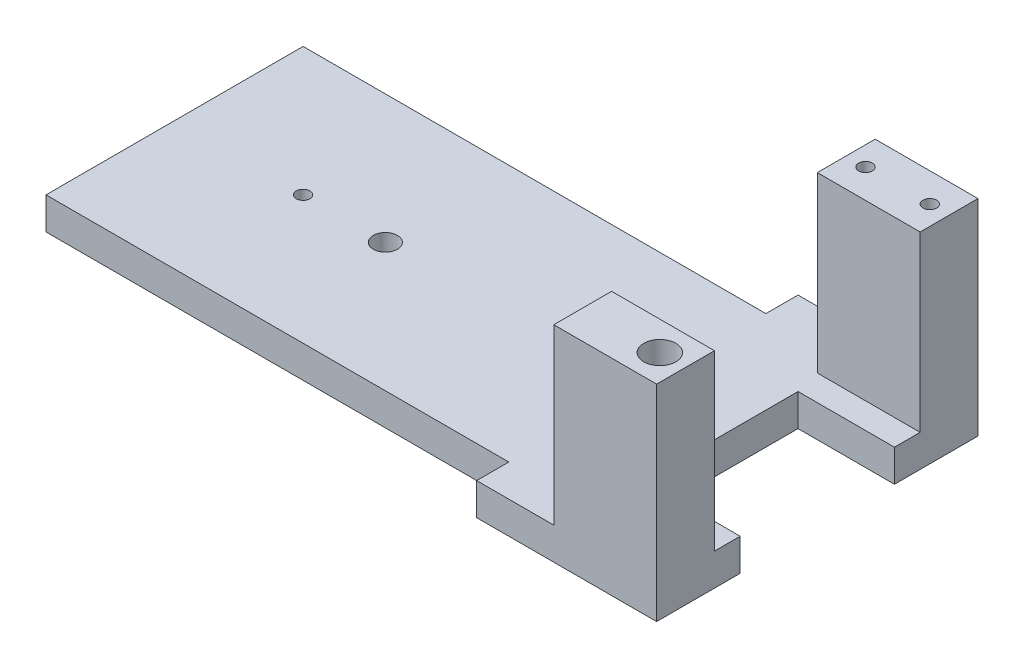
ISO-10303-21;
HEADER;
FILE_DESCRIPTION(('STEP AP214'),'2;1');
FILE_NAME('part.step','',(''),(''),'','','');
FILE_SCHEMA(('AUTOMOTIVE_DESIGN { 1 0 10303 214 1 1 1 1 }'));
ENDSEC;
DATA;
#1=APPLICATION_CONTEXT('core data for automotive mechanical design processes');
#2=APPLICATION_PROTOCOL_DEFINITION('international standard','automotive_design',2000,#1);
#3=PRODUCT_CONTEXT('',#1,'mechanical');
#4=PRODUCT('Part','Part','',(#3));
#5=PRODUCT_RELATED_PRODUCT_CATEGORY('part','',(#4));
#6=PRODUCT_DEFINITION_FORMATION('','',#4);
#7=PRODUCT_DEFINITION_CONTEXT('part definition',#1,'design');
#8=PRODUCT_DEFINITION('design','',#6,#7);
#9=PRODUCT_DEFINITION_SHAPE('','',#8);
#10=(LENGTH_UNIT() NAMED_UNIT(*) SI_UNIT(.MILLI.,.METRE.));
#11=(NAMED_UNIT(*) PLANE_ANGLE_UNIT() SI_UNIT($,.RADIAN.));
#12=(NAMED_UNIT(*) SI_UNIT($,.STERADIAN.) SOLID_ANGLE_UNIT());
#13=UNCERTAINTY_MEASURE_WITH_UNIT(LENGTH_MEASURE(1.E-05),#10,'distance_accuracy_value','');
#14=(GEOMETRIC_REPRESENTATION_CONTEXT(3) GLOBAL_UNCERTAINTY_ASSIGNED_CONTEXT((#13)) GLOBAL_UNIT_ASSIGNED_CONTEXT((#10,
#11,#12)) REPRESENTATION_CONTEXT('',''));
#15=CARTESIAN_POINT('',(0.,0.,0.));
#16=DIRECTION('',(0.,0.,1.));
#17=DIRECTION('',(1.,0.,0.));
#18=AXIS2_PLACEMENT_3D('',#15,#16,#17);
#19=CARTESIAN_POINT('',(127.,-6.35,-6.34999999999999));
#20=DIRECTION('',(1.,0.,0.));
#21=DIRECTION('',(0.,0.,-1.));
#22=AXIS2_PLACEMENT_3D('',#19,#20,#21);
#23=PLANE('',#22);
#24=DIRECTION('',(0.,1.,0.));
#25=VECTOR('',#24,1.);
#26=CARTESIAN_POINT('',(127.,-12.7,-22.86));
#27=LINE('',#26,#25);
#28=CARTESIAN_POINT('',(127.,-6.35,-22.86));
#29=VERTEX_POINT('',#28);
#30=CARTESIAN_POINT('',(127.,0.,-22.86));
#31=VERTEX_POINT('',#30);
#32=EDGE_CURVE('E186',#29,#31,#27,.T.);
#33=ORIENTED_EDGE('',*,*,#32,.T.);
#34=DIRECTION('',(0.,0.,-1.));
#35=VECTOR('',#34,1.);
#36=CARTESIAN_POINT('',(127.,0.,-6.34999999999999));
#37=LINE('',#36,#35);
#38=CARTESIAN_POINT('',(127.,0.,-17.78));
#39=VERTEX_POINT('',#38);
#40=EDGE_CURVE('E246',#39,#31,#37,.T.);
#41=ORIENTED_EDGE('',*,*,#40,.F.);
#42=DIRECTION('',(0.,-1.,0.));
#43=VECTOR('',#42,1.);
#44=CARTESIAN_POINT('',(127.,34.29,-17.78));
#45=LINE('',#44,#43);
#46=CARTESIAN_POINT('',(127.,34.29,-17.78));
#47=VERTEX_POINT('',#46);
#48=EDGE_CURVE('E214',#47,#39,#45,.T.);
#49=ORIENTED_EDGE('',*,*,#48,.F.);
#50=DIRECTION('',(0.,0.,-1.));
#51=VECTOR('',#50,1.);
#52=CARTESIAN_POINT('',(127.,34.29,0.));
#53=LINE('',#52,#51);
#54=CARTESIAN_POINT('',(127.,34.29,-6.34999999999999));
#55=VERTEX_POINT('',#54);
#56=EDGE_CURVE('E204',#55,#47,#53,.T.);
#57=ORIENTED_EDGE('',*,*,#56,.F.);
#58=DIRECTION('',(0.,1.,0.));
#59=VECTOR('',#58,1.);
#60=CARTESIAN_POINT('',(127.,-6.35,-6.34999999999999));
#61=LINE('',#60,#59);
#62=CARTESIAN_POINT('',(127.,-6.35,-6.34999999999999));
#63=VERTEX_POINT('',#62);
#64=EDGE_CURVE('E11',#63,#55,#61,.T.);
#65=ORIENTED_EDGE('',*,*,#64,.F.);
#66=DIRECTION('',(0.,0.,-1.));
#67=VECTOR('',#66,1.);
#68=CARTESIAN_POINT('',(127.,-6.35,-6.34999999999999));
#69=LINE('',#68,#67);
#70=EDGE_CURVE('E357',#63,#29,#69,.T.);
#71=ORIENTED_EDGE('',*,*,#70,.T.);
#72=EDGE_LOOP('',(#33,#41,#49,#57,#65,#71));
#73=FACE_BOUND('',#72,.T.);
#74=ADVANCED_FACE('F35',(#73),#23,.T.);
#75=DIRECTION('',(0.,1.,0.));
#76=VECTOR('',#75,1.);
#77=CARTESIAN_POINT('',(127.,-12.7,-53.34));
#78=LINE('',#77,#76);
#79=CARTESIAN_POINT('',(127.,-6.35,-53.34));
#80=VERTEX_POINT('',#79);
#81=CARTESIAN_POINT('',(127.,0.,-53.34));
#82=VERTEX_POINT('',#81);
#83=EDGE_CURVE('E53',#80,#82,#78,.T.);
#84=ORIENTED_EDGE('',*,*,#83,.F.);
#85=CARTESIAN_POINT('',(127.,-6.35,-69.85));
#86=VERTEX_POINT('',#85);
#87=EDGE_CURVE('E308',#80,#86,#69,.T.);
#88=ORIENTED_EDGE('',*,*,#87,.T.);
#89=DIRECTION('',(0.,1.,0.));
#90=VECTOR('',#89,1.);
#91=CARTESIAN_POINT('',(127.,-6.35,-69.85));
#92=LINE('',#91,#90);
#93=CARTESIAN_POINT('',(127.,34.29,-69.85));
#94=VERTEX_POINT('',#93);
#95=EDGE_CURVE('E261',#86,#94,#92,.T.);
#96=ORIENTED_EDGE('',*,*,#95,.T.);
#97=DIRECTION('',(0.,0.,-1.));
#98=VECTOR('',#97,1.);
#99=CARTESIAN_POINT('',(127.,34.29,0.));
#100=LINE('',#99,#98);
#101=CARTESIAN_POINT('',(127.,34.29,-58.42));
#102=VERTEX_POINT('',#101);
#103=EDGE_CURVE('E229',#102,#94,#100,.T.);
#104=ORIENTED_EDGE('',*,*,#103,.F.);
#105=DIRECTION('',(0.,-1.,0.));
#106=VECTOR('',#105,1.);
#107=CARTESIAN_POINT('',(127.,34.29,-58.42));
#108=LINE('',#107,#106);
#109=CARTESIAN_POINT('',(127.,0.,-58.42));
#110=VERTEX_POINT('',#109);
#111=EDGE_CURVE('E232',#102,#110,#108,.T.);
#112=ORIENTED_EDGE('',*,*,#111,.T.);
#113=EDGE_CURVE('E39',#82,#110,#37,.T.);
#114=ORIENTED_EDGE('',*,*,#113,.F.);
#115=EDGE_LOOP('',(#84,#88,#96,#104,#112,#114));
#116=FACE_BOUND('',#115,.T.);
#117=ADVANCED_FACE('F37',(#116),#23,.T.);
#118=CARTESIAN_POINT('',(91.44,-6.35,-6.35000000000001));
#119=DIRECTION('',(0.,0.,1.));
#120=DIRECTION('',(1.,0.,0.));
#121=AXIS2_PLACEMENT_3D('',#118,#119,#120);
#122=PLANE('',#121);
#123=DIRECTION('',(1.,0.,0.));
#124=VECTOR('',#123,1.);
#125=CARTESIAN_POINT('',(91.44,0.,-6.35000000000001));
#126=LINE('',#125,#124);
#127=CARTESIAN_POINT('',(91.44,0.,-6.35000000000001));
#128=VERTEX_POINT('',#127);
#129=CARTESIAN_POINT('',(106.68,0.,-6.35));
#130=VERTEX_POINT('',#129);
#131=EDGE_CURVE('E307',#128,#130,#126,.T.);
#132=ORIENTED_EDGE('',*,*,#131,.F.);
#133=DIRECTION('',(0.,1.,0.));
#134=VECTOR('',#133,1.);
#135=CARTESIAN_POINT('',(91.44,-6.35,-6.35000000000001));
#136=LINE('',#135,#134);
#137=CARTESIAN_POINT('',(91.44,-6.35,-6.35000000000001));
#138=VERTEX_POINT('',#137);
#139=EDGE_CURVE('E45',#138,#128,#136,.T.);
#140=ORIENTED_EDGE('',*,*,#139,.F.);
#141=DIRECTION('',(1.,0.,0.));
#142=VECTOR('',#141,1.);
#143=CARTESIAN_POINT('',(91.44,-6.35,-6.35000000000001));
#144=LINE('',#143,#142);
#145=EDGE_CURVE('E251',#138,#63,#144,.T.);
#146=ORIENTED_EDGE('',*,*,#145,.T.);
#147=ORIENTED_EDGE('',*,*,#64,.T.);
#148=DIRECTION('',(1.,0.,0.));
#149=VECTOR('',#148,1.);
#150=CARTESIAN_POINT('',(0.,34.29,-6.35000000000004));
#151=LINE('',#150,#149);
#152=CARTESIAN_POINT('',(106.68,34.29,-6.35));
#153=VERTEX_POINT('',#152);
#154=EDGE_CURVE('E201',#153,#55,#151,.T.);
#155=ORIENTED_EDGE('',*,*,#154,.F.);
#156=DIRECTION('',(0.,-1.,0.));
#157=VECTOR('',#156,1.);
#158=CARTESIAN_POINT('',(106.68,34.29,-6.35));
#159=LINE('',#158,#157);
#160=EDGE_CURVE('E217',#153,#130,#159,.T.);
#161=ORIENTED_EDGE('',*,*,#160,.T.);
#162=EDGE_LOOP('',(#132,#140,#146,#147,#155,#161));
#163=FACE_BOUND('',#162,.T.);
#164=ADVANCED_FACE('F343',(#163),#122,.T.);
#165=CARTESIAN_POINT('',(91.44,-6.35,-12.7));
#166=DIRECTION('',(-1.,0.,0.));
#167=DIRECTION('',(0.,0.,1.));
#168=AXIS2_PLACEMENT_3D('',#165,#166,#167);
#169=PLANE('',#168);
#170=DIRECTION('',(0.,0.,1.));
#171=VECTOR('',#170,1.);
#172=CARTESIAN_POINT('',(91.44,0.,-12.7));
#173=LINE('',#172,#171);
#174=CARTESIAN_POINT('',(91.44,0.,-12.7));
#175=VERTEX_POINT('',#174);
#176=EDGE_CURVE('E304',#175,#128,#173,.T.);
#177=ORIENTED_EDGE('',*,*,#176,.F.);
#178=DIRECTION('',(0.,1.,0.));
#179=VECTOR('',#178,1.);
#180=CARTESIAN_POINT('',(91.44,-6.35,-12.7));
#181=LINE('',#180,#179);
#182=CARTESIAN_POINT('',(91.44,-6.35,-12.7));
#183=VERTEX_POINT('',#182);
#184=EDGE_CURVE('E311',#183,#175,#181,.T.);
#185=ORIENTED_EDGE('',*,*,#184,.F.);
#186=DIRECTION('',(0.,0.,1.));
#187=VECTOR('',#186,1.);
#188=CARTESIAN_POINT('',(91.44,-6.35,-12.7));
#189=LINE('',#188,#187);
#190=EDGE_CURVE('E339',#183,#138,#189,.T.);
#191=ORIENTED_EDGE('',*,*,#190,.T.);
#192=ORIENTED_EDGE('',*,*,#139,.T.);
#193=EDGE_LOOP('',(#177,#185,#191,#192));
#194=FACE_BOUND('',#193,.T.);
#195=ADVANCED_FACE('F338',(#194),#169,.T.);
#196=CARTESIAN_POINT('',(0.,-6.35,-12.7));
#197=DIRECTION('',(0.,0.,1.));
#198=DIRECTION('',(1.,0.,0.));
#199=AXIS2_PLACEMENT_3D('',#196,#197,#198);
#200=PLANE('',#199);
#201=DIRECTION('',(1.,0.,0.));
#202=VECTOR('',#201,1.);
#203=CARTESIAN_POINT('',(0.,0.,-12.7));
#204=LINE('',#203,#202);
#205=CARTESIAN_POINT('',(0.,0.,-12.7));
#206=VERTEX_POINT('',#205);
#207=EDGE_CURVE('E299',#206,#175,#204,.T.);
#208=ORIENTED_EDGE('',*,*,#207,.F.);
#209=DIRECTION('',(0.,1.,0.));
#210=VECTOR('',#209,1.);
#211=CARTESIAN_POINT('',(0.,-6.35,-12.7));
#212=LINE('',#211,#210);
#213=CARTESIAN_POINT('',(0.,-6.35,-12.7));
#214=VERTEX_POINT('',#213);
#215=EDGE_CURVE('E313',#214,#206,#212,.T.);
#216=ORIENTED_EDGE('',*,*,#215,.F.);
#217=DIRECTION('',(1.,0.,0.));
#218=VECTOR('',#217,1.);
#219=CARTESIAN_POINT('',(0.,-6.35,-12.7));
#220=LINE('',#219,#218);
#221=EDGE_CURVE('E334',#214,#183,#220,.T.);
#222=ORIENTED_EDGE('',*,*,#221,.T.);
#223=ORIENTED_EDGE('',*,*,#184,.T.);
#224=EDGE_LOOP('',(#208,#216,#222,#223));
#225=FACE_BOUND('',#224,.T.);
#226=ADVANCED_FACE('F331',(#225),#200,.T.);
#227=CARTESIAN_POINT('',(0.,-6.35,-63.5));
#228=DIRECTION('',(-1.,0.,0.));
#229=DIRECTION('',(0.,0.,1.));
#230=AXIS2_PLACEMENT_3D('',#227,#228,#229);
#231=PLANE('',#230);
#232=DIRECTION('',(0.,0.,1.));
#233=VECTOR('',#232,1.);
#234=CARTESIAN_POINT('',(0.,0.,-63.5));
#235=LINE('',#234,#233);
#236=CARTESIAN_POINT('',(0.,0.,-63.5));
#237=VERTEX_POINT('',#236);
#238=EDGE_CURVE('E297',#237,#206,#235,.T.);
#239=ORIENTED_EDGE('',*,*,#238,.F.);
#240=DIRECTION('',(0.,1.,0.));
#241=VECTOR('',#240,1.);
#242=CARTESIAN_POINT('',(0.,-6.35,-63.5));
#243=LINE('',#242,#241);
#244=CARTESIAN_POINT('',(0.,-6.35,-63.5));
#245=VERTEX_POINT('',#244);
#246=EDGE_CURVE('E315',#245,#237,#243,.T.);
#247=ORIENTED_EDGE('',*,*,#246,.F.);
#248=DIRECTION('',(0.,0.,1.));
#249=VECTOR('',#248,1.);
#250=CARTESIAN_POINT('',(0.,-6.35,-63.5));
#251=LINE('',#250,#249);
#252=EDGE_CURVE('E372',#245,#214,#251,.T.);
#253=ORIENTED_EDGE('',*,*,#252,.T.);
#254=ORIENTED_EDGE('',*,*,#215,.T.);
#255=EDGE_LOOP('',(#239,#247,#253,#254));
#256=FACE_BOUND('',#255,.T.);
#257=ADVANCED_FACE('F326',(#256),#231,.T.);
#258=CARTESIAN_POINT('',(0.,-6.35,-63.5));
#259=DIRECTION('',(0.,0.,-1.));
#260=DIRECTION('',(-1.,0.,0.));
#261=AXIS2_PLACEMENT_3D('',#258,#259,#260);
#262=PLANE('',#261);
#263=DIRECTION('',(-1.,0.,0.));
#264=VECTOR('',#263,1.);
#265=CARTESIAN_POINT('',(0.,0.,-63.5));
#266=LINE('',#265,#264);
#267=CARTESIAN_POINT('',(91.44,0.,-63.5));
#268=VERTEX_POINT('',#267);
#269=EDGE_CURVE('E296',#268,#237,#266,.T.);
#270=ORIENTED_EDGE('',*,*,#269,.F.);
#271=DIRECTION('',(0.,1.,0.));
#272=VECTOR('',#271,1.);
#273=CARTESIAN_POINT('',(91.44,-6.35,-63.5));
#274=LINE('',#273,#272);
#275=CARTESIAN_POINT('',(91.44,-6.35,-63.5));
#276=VERTEX_POINT('',#275);
#277=EDGE_CURVE('E292',#276,#268,#274,.T.);
#278=ORIENTED_EDGE('',*,*,#277,.F.);
#279=DIRECTION('',(-1.,0.,0.));
#280=VECTOR('',#279,1.);
#281=CARTESIAN_POINT('',(0.,-6.35,-63.5));
#282=LINE('',#281,#280);
#283=EDGE_CURVE('E322',#276,#245,#282,.T.);
#284=ORIENTED_EDGE('',*,*,#283,.T.);
#285=ORIENTED_EDGE('',*,*,#246,.T.);
#286=EDGE_LOOP('',(#270,#278,#284,#285));
#287=FACE_BOUND('',#286,.T.);
#288=ADVANCED_FACE('F320',(#287),#262,.T.);
#289=CARTESIAN_POINT('',(91.44,-6.35,-63.5));
#290=DIRECTION('',(-1.,0.,0.));
#291=DIRECTION('',(0.,0.,1.));
#292=AXIS2_PLACEMENT_3D('',#289,#290,#291);
#293=PLANE('',#292);
#294=DIRECTION('',(0.,0.,1.));
#295=VECTOR('',#294,1.);
#296=CARTESIAN_POINT('',(91.44,0.,-63.5));
#297=LINE('',#296,#295);
#298=CARTESIAN_POINT('',(91.44,0.,-69.85));
#299=VERTEX_POINT('',#298);
#300=EDGE_CURVE('E256',#299,#268,#297,.T.);
#301=ORIENTED_EDGE('',*,*,#300,.F.);
#302=DIRECTION('',(0.,1.,0.));
#303=VECTOR('',#302,1.);
#304=CARTESIAN_POINT('',(91.44,-6.35,-69.85));
#305=LINE('',#304,#303);
#306=CARTESIAN_POINT('',(91.44,-6.35,-69.85));
#307=VERTEX_POINT('',#306);
#308=EDGE_CURVE('E284',#307,#299,#305,.T.);
#309=ORIENTED_EDGE('',*,*,#308,.F.);
#310=DIRECTION('',(0.,0.,1.));
#311=VECTOR('',#310,1.);
#312=CARTESIAN_POINT('',(91.44,-6.35,-63.5));
#313=LINE('',#312,#311);
#314=EDGE_CURVE('E367',#307,#276,#313,.T.);
#315=ORIENTED_EDGE('',*,*,#314,.T.);
#316=ORIENTED_EDGE('',*,*,#277,.T.);
#317=EDGE_LOOP('',(#301,#309,#315,#316));
#318=FACE_BOUND('',#317,.T.);
#319=ADVANCED_FACE('F293',(#318),#293,.T.);
#320=CARTESIAN_POINT('',(127.,-6.35,-69.85));
#321=DIRECTION('',(0.,0.,-1.));
#322=DIRECTION('',(-1.,0.,0.));
#323=AXIS2_PLACEMENT_3D('',#320,#321,#322);
#324=PLANE('',#323);
#325=DIRECTION('',(-1.,0.,0.));
#326=VECTOR('',#325,1.);
#327=CARTESIAN_POINT('',(127.,0.,-69.85));
#328=LINE('',#327,#326);
#329=CARTESIAN_POINT('',(106.68,0.,-69.85));
#330=VERTEX_POINT('',#329);
#331=EDGE_CURVE('E247',#330,#299,#328,.T.);
#332=ORIENTED_EDGE('',*,*,#331,.F.);
#333=DIRECTION('',(0.,-1.,0.));
#334=VECTOR('',#333,1.);
#335=CARTESIAN_POINT('',(106.68,34.29,-69.85));
#336=LINE('',#335,#334);
#337=CARTESIAN_POINT('',(106.68,34.29,-69.85));
#338=VERTEX_POINT('',#337);
#339=EDGE_CURVE('E266',#338,#330,#336,.T.);
#340=ORIENTED_EDGE('',*,*,#339,.F.);
#341=DIRECTION('',(-1.,0.,0.));
#342=VECTOR('',#341,1.);
#343=CARTESIAN_POINT('',(0.,34.29,-69.8499999999999));
#344=LINE('',#343,#342);
#345=EDGE_CURVE('E221',#94,#338,#344,.T.);
#346=ORIENTED_EDGE('',*,*,#345,.F.);
#347=ORIENTED_EDGE('',*,*,#95,.F.);
#348=DIRECTION('',(-1.,0.,0.));
#349=VECTOR('',#348,1.);
#350=CARTESIAN_POINT('',(127.,-6.35,-69.85));
#351=LINE('',#350,#349);
#352=EDGE_CURVE('E288',#86,#307,#351,.T.);
#353=ORIENTED_EDGE('',*,*,#352,.T.);
#354=ORIENTED_EDGE('',*,*,#308,.T.);
#355=EDGE_LOOP('',(#332,#340,#346,#347,#353,#354));
#356=FACE_BOUND('',#355,.T.);
#357=ADVANCED_FACE('F281',(#356),#324,.T.);
#358=CARTESIAN_POINT('',(0.,-6.35,0.));
#359=DIRECTION('',(0.,1.,0.));
#360=DIRECTION('',(0.,0.,1.));
#361=AXIS2_PLACEMENT_3D('',#358,#359,#360);
#362=PLANE('',#361);
#363=CARTESIAN_POINT('',(123.19,-6.35,-64.135));
#364=DIRECTION('',(0.,1.,0.));
#365=DIRECTION('',(0.,0.,1.));
#366=AXIS2_PLACEMENT_3D('',#363,#364,#365);
#367=CIRCLE('',#366,1.35254999999999);
#368=CARTESIAN_POINT('',(123.19,-6.35,-62.78245));
#369=VERTEX_POINT('',#368);
#370=EDGE_CURVE('E568',#369,#369,#367,.T.);
#371=ORIENTED_EDGE('',*,*,#370,.T.);
#372=EDGE_LOOP('',(#371));
#373=FACE_BOUND('',#372,.T.);
#374=CARTESIAN_POINT('',(110.49,-6.35,-64.135));
#375=DIRECTION('',(0.,1.,0.));
#376=DIRECTION('',(0.,0.,1.));
#377=AXIS2_PLACEMENT_3D('',#374,#375,#376);
#378=CIRCLE('',#377,1.35254999999999);
#379=CARTESIAN_POINT('',(110.49,-6.35,-62.78245));
#380=VERTEX_POINT('',#379);
#381=EDGE_CURVE('E577',#380,#380,#378,.T.);
#382=ORIENTED_EDGE('',*,*,#381,.T.);
#383=EDGE_LOOP('',(#382));
#384=FACE_BOUND('',#383,.T.);
#385=CARTESIAN_POINT('',(25.4,-6.35,-38.1));
#386=DIRECTION('',(0.,1.,0.));
#387=DIRECTION('',(0.,0.,1.));
#388=AXIS2_PLACEMENT_3D('',#385,#386,#387);
#389=CIRCLE('',#388,1.35255);
#390=CARTESIAN_POINT('',(25.4,-6.35,-36.74745));
#391=VERTEX_POINT('',#390);
#392=EDGE_CURVE('E583',#391,#391,#389,.T.);
#393=ORIENTED_EDGE('',*,*,#392,.T.);
#394=EDGE_LOOP('',(#393));
#395=FACE_BOUND('',#394,.T.);
#396=CARTESIAN_POINT('',(79.375,-6.35,-38.1));
#397=DIRECTION('',(0.,1.,0.));
#398=DIRECTION('',(0.,0.,1.));
#399=AXIS2_PLACEMENT_3D('',#396,#397,#398);
#400=CIRCLE('',#399,1.35254999999999);
#401=CARTESIAN_POINT('',(79.375,-6.35,-36.74745));
#402=VERTEX_POINT('',#401);
#403=EDGE_CURVE('E589',#402,#402,#400,.T.);
#404=ORIENTED_EDGE('',*,*,#403,.T.);
#405=EDGE_LOOP('',(#404));
#406=FACE_BOUND('',#405,.T.);
#407=CARTESIAN_POINT('',(121.92,-6.35,-12.065));
#408=DIRECTION('',(0.,1.,0.));
#409=DIRECTION('',(0.,0.,1.));
#410=AXIS2_PLACEMENT_3D('',#407,#408,#409);
#411=CIRCLE('',#410,3.17499999999998);
#412=CARTESIAN_POINT('',(121.92,-6.35,-8.89000000000002));
#413=VERTEX_POINT('',#412);
#414=EDGE_CURVE('E595',#413,#413,#411,.T.);
#415=ORIENTED_EDGE('',*,*,#414,.T.);
#416=EDGE_LOOP('',(#415));
#417=FACE_BOUND('',#416,.T.);
#418=CARTESIAN_POINT('',(41.656,-6.35,-38.1));
#419=DIRECTION('',(0.,1.,0.));
#420=DIRECTION('',(0.,0.,1.));
#421=AXIS2_PLACEMENT_3D('',#418,#419,#420);
#422=CIRCLE('',#421,2.38125);
#423=CARTESIAN_POINT('',(41.656,-6.35,-35.71875));
#424=VERTEX_POINT('',#423);
#425=EDGE_CURVE('E178',#424,#424,#422,.T.);
#426=ORIENTED_EDGE('',*,*,#425,.T.);
#427=EDGE_LOOP('',(#426));
#428=FACE_BOUND('',#427,.T.);
#429=DIRECTION('',(0.,0.,1.));
#430=VECTOR('',#429,1.);
#431=CARTESIAN_POINT('',(107.95,-6.35,0.));
#432=LINE('',#431,#430);
#433=CARTESIAN_POINT('',(107.95,-6.35,-53.34));
#434=VERTEX_POINT('',#433);
#435=CARTESIAN_POINT('',(107.95,-6.35,-22.86));
#436=VERTEX_POINT('',#435);
#437=EDGE_CURVE('E171',#434,#436,#432,.T.);
#438=ORIENTED_EDGE('',*,*,#437,.T.);
#439=DIRECTION('',(1.,0.,0.));
#440=VECTOR('',#439,1.);
#441=CARTESIAN_POINT('',(0.,-6.35,-22.86));
#442=LINE('',#441,#440);
#443=EDGE_CURVE('E194',#436,#29,#442,.T.);
#444=ORIENTED_EDGE('',*,*,#443,.T.);
#445=ORIENTED_EDGE('',*,*,#70,.F.);
#446=ORIENTED_EDGE('',*,*,#145,.F.);
#447=ORIENTED_EDGE('',*,*,#190,.F.);
#448=ORIENTED_EDGE('',*,*,#221,.F.);
#449=ORIENTED_EDGE('',*,*,#252,.F.);
#450=ORIENTED_EDGE('',*,*,#283,.F.);
#451=ORIENTED_EDGE('',*,*,#314,.F.);
#452=ORIENTED_EDGE('',*,*,#352,.F.);
#453=ORIENTED_EDGE('',*,*,#87,.F.);
#454=DIRECTION('',(-1.,0.,0.));
#455=VECTOR('',#454,1.);
#456=CARTESIAN_POINT('',(0.,-6.35,-53.3399999999999));
#457=LINE('',#456,#455);
#458=EDGE_CURVE('E189',#80,#434,#457,.T.);
#459=ORIENTED_EDGE('',*,*,#458,.T.);
#460=EDGE_LOOP('',(#438,#444,#445,#446,#447,#448,#449,#450,#451,#452,#453,#459));
#461=FACE_BOUND('',#460,.T.);
#462=ADVANCED_FACE('F361',(#373,#384,#395,#406,#417,#428,#461),#362,.F.);
#463=CARTESIAN_POINT('',(0.,0.,0.));
#464=DIRECTION('',(0.,1.,0.));
#465=DIRECTION('',(0.,0.,1.));
#466=AXIS2_PLACEMENT_3D('',#463,#464,#465);
#467=PLANE('',#466);
#468=CARTESIAN_POINT('',(25.4,0.,-38.1));
#469=DIRECTION('',(0.,1.,0.));
#470=DIRECTION('',(0.,0.,1.));
#471=AXIS2_PLACEMENT_3D('',#468,#469,#470);
#472=CIRCLE('',#471,1.35255);
#473=CARTESIAN_POINT('',(25.4,0.,-36.74745));
#474=VERTEX_POINT('',#473);
#475=EDGE_CURVE('E580',#474,#474,#472,.T.);
#476=ORIENTED_EDGE('',*,*,#475,.F.);
#477=EDGE_LOOP('',(#476));
#478=FACE_BOUND('',#477,.T.);
#479=CARTESIAN_POINT('',(79.375,0.,-38.1));
#480=DIRECTION('',(0.,1.,0.));
#481=DIRECTION('',(0.,0.,1.));
#482=AXIS2_PLACEMENT_3D('',#479,#480,#481);
#483=CIRCLE('',#482,1.35254999999999);
#484=CARTESIAN_POINT('',(79.375,0.,-36.74745));
#485=VERTEX_POINT('',#484);
#486=EDGE_CURVE('E586',#485,#485,#483,.T.);
#487=ORIENTED_EDGE('',*,*,#486,.F.);
#488=EDGE_LOOP('',(#487));
#489=FACE_BOUND('',#488,.T.);
#490=CARTESIAN_POINT('',(41.656,0.,-38.1));
#491=DIRECTION('',(0.,1.,0.));
#492=DIRECTION('',(0.,0.,1.));
#493=AXIS2_PLACEMENT_3D('',#490,#491,#492);
#494=CIRCLE('',#493,2.38125);
#495=CARTESIAN_POINT('',(41.656,0.,-35.71875));
#496=VERTEX_POINT('',#495);
#497=EDGE_CURVE('E598',#496,#496,#494,.T.);
#498=ORIENTED_EDGE('',*,*,#497,.F.);
#499=EDGE_LOOP('',(#498));
#500=FACE_BOUND('',#499,.T.);
#501=DIRECTION('',(1.,0.,0.));
#502=VECTOR('',#501,1.);
#503=CARTESIAN_POINT('',(107.95,0.,-22.86));
#504=LINE('',#503,#502);
#505=CARTESIAN_POINT('',(107.95,0.,-22.86));
#506=VERTEX_POINT('',#505);
#507=EDGE_CURVE('E181',#506,#31,#504,.T.);
#508=ORIENTED_EDGE('',*,*,#507,.F.);
#509=DIRECTION('',(0.,0.,1.));
#510=VECTOR('',#509,1.);
#511=CARTESIAN_POINT('',(107.95,0.,-53.34));
#512=LINE('',#511,#510);
#513=CARTESIAN_POINT('',(107.95,0.,-53.34));
#514=VERTEX_POINT('',#513);
#515=EDGE_CURVE('E168',#514,#506,#512,.T.);
#516=ORIENTED_EDGE('',*,*,#515,.F.);
#517=DIRECTION('',(-1.,0.,0.));
#518=VECTOR('',#517,1.);
#519=CARTESIAN_POINT('',(127.,0.,-53.34));
#520=LINE('',#519,#518);
#521=EDGE_CURVE('E175',#82,#514,#520,.T.);
#522=ORIENTED_EDGE('',*,*,#521,.F.);
#523=ORIENTED_EDGE('',*,*,#113,.T.);
#524=DIRECTION('',(1.,0.,0.));
#525=VECTOR('',#524,1.);
#526=CARTESIAN_POINT('',(0.,0.,-58.42));
#527=LINE('',#526,#525);
#528=CARTESIAN_POINT('',(106.68,0.,-58.42));
#529=VERTEX_POINT('',#528);
#530=EDGE_CURVE('E225',#529,#110,#527,.T.);
#531=ORIENTED_EDGE('',*,*,#530,.F.);
#532=DIRECTION('',(0.,0.,1.));
#533=VECTOR('',#532,1.);
#534=CARTESIAN_POINT('',(106.68,0.,0.));
#535=LINE('',#534,#533);
#536=EDGE_CURVE('E220',#330,#529,#535,.T.);
#537=ORIENTED_EDGE('',*,*,#536,.F.);
#538=ORIENTED_EDGE('',*,*,#331,.T.);
#539=ORIENTED_EDGE('',*,*,#300,.T.);
#540=ORIENTED_EDGE('',*,*,#269,.T.);
#541=ORIENTED_EDGE('',*,*,#238,.T.);
#542=ORIENTED_EDGE('',*,*,#207,.T.);
#543=ORIENTED_EDGE('',*,*,#176,.T.);
#544=ORIENTED_EDGE('',*,*,#131,.T.);
#545=DIRECTION('',(0.,0.,-1.));
#546=VECTOR('',#545,1.);
#547=CARTESIAN_POINT('',(106.68,0.,-1.29526019539602E-13));
#548=LINE('',#547,#546);
#549=CARTESIAN_POINT('',(106.68,0.,-17.78));
#550=VERTEX_POINT('',#549);
#551=EDGE_CURVE('E197',#130,#550,#548,.T.);
#552=ORIENTED_EDGE('',*,*,#551,.T.);
#553=DIRECTION('',(1.,0.,0.));
#554=VECTOR('',#553,1.);
#555=CARTESIAN_POINT('',(0.,0.,-17.7799999999999));
#556=LINE('',#555,#554);
#557=EDGE_CURVE('E61',#550,#39,#556,.T.);
#558=ORIENTED_EDGE('',*,*,#557,.T.);
#559=ORIENTED_EDGE('',*,*,#40,.T.);
#560=EDGE_LOOP('',(#508,#516,#522,#523,#531,#537,#538,#539,#540,#541,#542,#543,#544,#552,#558,#559));
#561=FACE_BOUND('',#560,.T.);
#562=ADVANCED_FACE('F180',(#478,#489,#500,#561),#467,.T.);
#563=CARTESIAN_POINT('',(106.68,34.29,0.));
#564=DIRECTION('',(1.,0.,0.));
#565=DIRECTION('',(0.,0.,-1.));
#566=AXIS2_PLACEMENT_3D('',#563,#564,#565);
#567=PLANE('',#566);
#568=ORIENTED_EDGE('',*,*,#536,.T.);
#569=DIRECTION('',(0.,-1.,0.));
#570=VECTOR('',#569,1.);
#571=CARTESIAN_POINT('',(106.68,34.29,-58.42));
#572=LINE('',#571,#570);
#573=CARTESIAN_POINT('',(106.68,34.29,-58.42));
#574=VERTEX_POINT('',#573);
#575=EDGE_CURVE('E235',#574,#529,#572,.T.);
#576=ORIENTED_EDGE('',*,*,#575,.F.);
#577=DIRECTION('',(0.,0.,1.));
#578=VECTOR('',#577,1.);
#579=CARTESIAN_POINT('',(106.68,34.29,0.));
#580=LINE('',#579,#578);
#581=EDGE_CURVE('E224',#338,#574,#580,.T.);
#582=ORIENTED_EDGE('',*,*,#581,.F.);
#583=ORIENTED_EDGE('',*,*,#339,.T.);
#584=EDGE_LOOP('',(#568,#576,#582,#583));
#585=FACE_BOUND('',#584,.T.);
#586=ADVANCED_FACE('F276',(#585),#567,.F.);
#587=CARTESIAN_POINT('',(0.,34.29,-58.42));
#588=DIRECTION('',(0.,0.,-1.));
#589=DIRECTION('',(-1.,0.,0.));
#590=AXIS2_PLACEMENT_3D('',#587,#588,#589);
#591=PLANE('',#590);
#592=ORIENTED_EDGE('',*,*,#530,.T.);
#593=ORIENTED_EDGE('',*,*,#111,.F.);
#594=DIRECTION('',(1.,0.,0.));
#595=VECTOR('',#594,1.);
#596=CARTESIAN_POINT('',(0.,34.29,-58.42));
#597=LINE('',#596,#595);
#598=EDGE_CURVE('E227',#574,#102,#597,.T.);
#599=ORIENTED_EDGE('',*,*,#598,.F.);
#600=ORIENTED_EDGE('',*,*,#575,.T.);
#601=EDGE_LOOP('',(#592,#593,#599,#600));
#602=FACE_BOUND('',#601,.T.);
#603=ADVANCED_FACE('F274',(#602),#591,.F.);
#604=CARTESIAN_POINT('',(0.,34.29,0.));
#605=DIRECTION('',(0.,1.,0.));
#606=DIRECTION('',(0.,0.,1.));
#607=AXIS2_PLACEMENT_3D('',#604,#605,#606);
#608=PLANE('',#607);
#609=CARTESIAN_POINT('',(123.19,34.29,-64.135));
#610=DIRECTION('',(0.,1.,0.));
#611=DIRECTION('',(0.,0.,1.));
#612=AXIS2_PLACEMENT_3D('',#609,#610,#611);
#613=CIRCLE('',#612,1.35254999999999);
#614=CARTESIAN_POINT('',(123.19,34.29,-62.78245));
#615=VERTEX_POINT('',#614);
#616=EDGE_CURVE('E570',#615,#615,#613,.T.);
#617=ORIENTED_EDGE('',*,*,#616,.F.);
#618=EDGE_LOOP('',(#617));
#619=FACE_BOUND('',#618,.T.);
#620=CARTESIAN_POINT('',(110.49,34.29,-64.135));
#621=DIRECTION('',(0.,1.,0.));
#622=DIRECTION('',(0.,0.,1.));
#623=AXIS2_PLACEMENT_3D('',#620,#621,#622);
#624=CIRCLE('',#623,1.35254999999999);
#625=CARTESIAN_POINT('',(110.49,34.29,-62.78245));
#626=VERTEX_POINT('',#625);
#627=EDGE_CURVE('E572',#626,#626,#624,.T.);
#628=ORIENTED_EDGE('',*,*,#627,.F.);
#629=EDGE_LOOP('',(#628));
#630=FACE_BOUND('',#629,.T.);
#631=ORIENTED_EDGE('',*,*,#345,.T.);
#632=ORIENTED_EDGE('',*,*,#581,.T.);
#633=ORIENTED_EDGE('',*,*,#598,.T.);
#634=ORIENTED_EDGE('',*,*,#103,.T.);
#635=EDGE_LOOP('',(#631,#632,#633,#634));
#636=FACE_BOUND('',#635,.T.);
#637=ADVANCED_FACE('F366',(#619,#630,#636),#608,.T.);
#638=CARTESIAN_POINT('',(106.68,34.29,-1.29526019539602E-13));
#639=DIRECTION('',(-1.,0.,0.));
#640=DIRECTION('',(0.,0.,1.));
#641=AXIS2_PLACEMENT_3D('',#638,#639,#640);
#642=PLANE('',#641);
#643=ORIENTED_EDGE('',*,*,#551,.F.);
#644=ORIENTED_EDGE('',*,*,#160,.F.);
#645=DIRECTION('',(0.,0.,-1.));
#646=VECTOR('',#645,1.);
#647=CARTESIAN_POINT('',(106.68,34.29,-1.29526019539602E-13));
#648=LINE('',#647,#646);
#649=CARTESIAN_POINT('',(106.68,34.29,-17.78));
#650=VERTEX_POINT('',#649);
#651=EDGE_CURVE('E198',#153,#650,#648,.T.);
#652=ORIENTED_EDGE('',*,*,#651,.T.);
#653=DIRECTION('',(0.,-1.,0.));
#654=VECTOR('',#653,1.);
#655=CARTESIAN_POINT('',(106.68,34.29,-17.78));
#656=LINE('',#655,#654);
#657=EDGE_CURVE('E209',#650,#550,#656,.T.);
#658=ORIENTED_EDGE('',*,*,#657,.T.);
#659=EDGE_LOOP('',(#643,#644,#652,#658));
#660=FACE_BOUND('',#659,.T.);
#661=ADVANCED_FACE('F347',(#660),#642,.T.);
#662=CARTESIAN_POINT('',(0.,34.29,-17.7799999999999));
#663=DIRECTION('',(0.,0.,-1.));
#664=DIRECTION('',(-1.,0.,0.));
#665=AXIS2_PLACEMENT_3D('',#662,#663,#664);
#666=PLANE('',#665);
#667=ORIENTED_EDGE('',*,*,#557,.F.);
#668=ORIENTED_EDGE('',*,*,#657,.F.);
#669=DIRECTION('',(1.,0.,0.));
#670=VECTOR('',#669,1.);
#671=CARTESIAN_POINT('',(0.,34.29,-17.7799999999999));
#672=LINE('',#671,#670);
#673=EDGE_CURVE('E206',#650,#47,#672,.T.);
#674=ORIENTED_EDGE('',*,*,#673,.T.);
#675=ORIENTED_EDGE('',*,*,#48,.T.);
#676=EDGE_LOOP('',(#667,#668,#674,#675));
#677=FACE_BOUND('',#676,.T.);
#678=ADVANCED_FACE('F351',(#677),#666,.T.);
#679=CARTESIAN_POINT('',(0.,34.29,0.));
#680=DIRECTION('',(0.,1.,0.));
#681=DIRECTION('',(0.,0.,1.));
#682=AXIS2_PLACEMENT_3D('',#679,#680,#681);
#683=PLANE('',#682);
#684=CARTESIAN_POINT('',(121.92,34.29,-12.065));
#685=DIRECTION('',(0.,1.,0.));
#686=DIRECTION('',(0.,0.,1.));
#687=AXIS2_PLACEMENT_3D('',#684,#685,#686);
#688=CIRCLE('',#687,3.17499999999998);
#689=CARTESIAN_POINT('',(121.92,34.29,-8.89000000000002));
#690=VERTEX_POINT('',#689);
#691=EDGE_CURVE('E592',#690,#690,#688,.T.);
#692=ORIENTED_EDGE('',*,*,#691,.F.);
#693=EDGE_LOOP('',(#692));
#694=FACE_BOUND('',#693,.T.);
#695=ORIENTED_EDGE('',*,*,#651,.F.);
#696=ORIENTED_EDGE('',*,*,#154,.T.);
#697=ORIENTED_EDGE('',*,*,#56,.T.);
#698=ORIENTED_EDGE('',*,*,#673,.F.);
#699=EDGE_LOOP('',(#695,#696,#697,#698));
#700=FACE_BOUND('',#699,.T.);
#701=ADVANCED_FACE('F443',(#694,#700),#683,.T.);
#702=CARTESIAN_POINT('',(107.95,-12.7,-22.86));
#703=DIRECTION('',(0.,0.,1.));
#704=DIRECTION('',(1.,0.,0.));
#705=AXIS2_PLACEMENT_3D('',#702,#703,#704);
#706=PLANE('',#705);
#707=DIRECTION('',(0.,1.,0.));
#708=VECTOR('',#707,1.);
#709=CARTESIAN_POINT('',(107.95,-12.7,-22.86));
#710=LINE('',#709,#708);
#711=EDGE_CURVE('E173',#436,#506,#710,.T.);
#712=ORIENTED_EDGE('',*,*,#711,.T.);
#713=ORIENTED_EDGE('',*,*,#507,.T.);
#714=ORIENTED_EDGE('',*,*,#32,.F.);
#715=ORIENTED_EDGE('',*,*,#443,.F.);
#716=EDGE_LOOP('',(#712,#713,#714,#715));
#717=FACE_BOUND('',#716,.T.);
#718=ADVANCED_FACE('F359',(#717),#706,.F.);
#719=CARTESIAN_POINT('',(107.95,-12.7,-53.34));
#720=DIRECTION('',(-1.,0.,0.));
#721=DIRECTION('',(0.,0.,1.));
#722=AXIS2_PLACEMENT_3D('',#719,#720,#721);
#723=PLANE('',#722);
#724=DIRECTION('',(0.,1.,0.));
#725=VECTOR('',#724,1.);
#726=CARTESIAN_POINT('',(107.95,-12.7,-53.34));
#727=LINE('',#726,#725);
#728=EDGE_CURVE('E164',#434,#514,#727,.T.);
#729=ORIENTED_EDGE('',*,*,#728,.T.);
#730=ORIENTED_EDGE('',*,*,#515,.T.);
#731=ORIENTED_EDGE('',*,*,#711,.F.);
#732=ORIENTED_EDGE('',*,*,#437,.F.);
#733=EDGE_LOOP('',(#729,#730,#731,#732));
#734=FACE_BOUND('',#733,.T.);
#735=ADVANCED_FACE('F165',(#734),#723,.F.);
#736=CARTESIAN_POINT('',(127.,-12.7,-53.34));
#737=DIRECTION('',(0.,0.,-1.));
#738=DIRECTION('',(-1.,0.,0.));
#739=AXIS2_PLACEMENT_3D('',#736,#737,#738);
#740=PLANE('',#739);
#741=ORIENTED_EDGE('',*,*,#83,.T.);
#742=ORIENTED_EDGE('',*,*,#521,.T.);
#743=ORIENTED_EDGE('',*,*,#728,.F.);
#744=ORIENTED_EDGE('',*,*,#458,.F.);
#745=EDGE_LOOP('',(#741,#742,#743,#744));
#746=FACE_BOUND('',#745,.T.);
#747=ADVANCED_FACE('F176',(#746),#740,.F.);
#748=CARTESIAN_POINT('',(41.656,0.,-38.1));
#749=DIRECTION('',(0.,1.,0.));
#750=DIRECTION('',(0.,0.,1.));
#751=AXIS2_PLACEMENT_3D('',#748,#749,#750);
#752=CYLINDRICAL_SURFACE('',#751,2.38125);
#753=ORIENTED_EDGE('',*,*,#425,.F.);
#754=EDGE_LOOP('',(#753));
#755=FACE_BOUND('',#754,.T.);
#756=ORIENTED_EDGE('',*,*,#497,.T.);
#757=EDGE_LOOP('',(#756));
#758=FACE_BOUND('',#757,.T.);
#759=ADVANCED_FACE('F482',(#755,#758),#752,.F.);
#760=CARTESIAN_POINT('',(121.92,34.29,-12.065));
#761=DIRECTION('',(0.,1.,0.));
#762=DIRECTION('',(0.,0.,1.));
#763=AXIS2_PLACEMENT_3D('',#760,#761,#762);
#764=CYLINDRICAL_SURFACE('',#763,3.17499999999998);
#765=ORIENTED_EDGE('',*,*,#414,.F.);
#766=EDGE_LOOP('',(#765));
#767=FACE_BOUND('',#766,.T.);
#768=ORIENTED_EDGE('',*,*,#691,.T.);
#769=EDGE_LOOP('',(#768));
#770=FACE_BOUND('',#769,.T.);
#771=ADVANCED_FACE('F491',(#767,#770),#764,.F.);
#772=CARTESIAN_POINT('',(79.375,0.,-38.1));
#773=DIRECTION('',(0.,1.,0.));
#774=DIRECTION('',(0.,0.,1.));
#775=AXIS2_PLACEMENT_3D('',#772,#773,#774);
#776=CYLINDRICAL_SURFACE('',#775,1.35254999999999);
#777=ORIENTED_EDGE('',*,*,#403,.F.);
#778=EDGE_LOOP('',(#777));
#779=FACE_BOUND('',#778,.T.);
#780=ORIENTED_EDGE('',*,*,#486,.T.);
#781=EDGE_LOOP('',(#780));
#782=FACE_BOUND('',#781,.T.);
#783=ADVANCED_FACE('F508',(#779,#782),#776,.F.);
#784=CARTESIAN_POINT('',(25.4,0.,-38.1));
#785=DIRECTION('',(0.,1.,0.));
#786=DIRECTION('',(0.,0.,1.));
#787=AXIS2_PLACEMENT_3D('',#784,#785,#786);
#788=CYLINDRICAL_SURFACE('',#787,1.35255);
#789=ORIENTED_EDGE('',*,*,#392,.F.);
#790=EDGE_LOOP('',(#789));
#791=FACE_BOUND('',#790,.T.);
#792=ORIENTED_EDGE('',*,*,#475,.T.);
#793=EDGE_LOOP('',(#792));
#794=FACE_BOUND('',#793,.T.);
#795=ADVANCED_FACE('F525',(#791,#794),#788,.F.);
#796=CARTESIAN_POINT('',(110.49,34.29,-64.135));
#797=DIRECTION('',(0.,1.,0.));
#798=DIRECTION('',(0.,0.,1.));
#799=AXIS2_PLACEMENT_3D('',#796,#797,#798);
#800=CYLINDRICAL_SURFACE('',#799,1.35254999999999);
#801=ORIENTED_EDGE('',*,*,#381,.F.);
#802=EDGE_LOOP('',(#801));
#803=FACE_BOUND('',#802,.T.);
#804=ORIENTED_EDGE('',*,*,#627,.T.);
#805=EDGE_LOOP('',(#804));
#806=FACE_BOUND('',#805,.T.);
#807=ADVANCED_FACE('F534',(#803,#806),#800,.F.);
#808=CARTESIAN_POINT('',(123.19,34.29,-64.135));
#809=DIRECTION('',(0.,1.,0.));
#810=DIRECTION('',(0.,0.,1.));
#811=AXIS2_PLACEMENT_3D('',#808,#809,#810);
#812=CYLINDRICAL_SURFACE('',#811,1.35254999999999);
#813=ORIENTED_EDGE('',*,*,#370,.F.);
#814=EDGE_LOOP('',(#813));
#815=FACE_BOUND('',#814,.T.);
#816=ORIENTED_EDGE('',*,*,#616,.T.);
#817=EDGE_LOOP('',(#816));
#818=FACE_BOUND('',#817,.T.);
#819=ADVANCED_FACE('F552',(#815,#818),#812,.F.);
#820=CLOSED_SHELL('',(#74,#117,#164,#195,#226,#257,#288,#319,#357,#462,#562,#586,#603,#637,#661,
#678,#701,#718,#735,#747,#759,#771,#783,#795,#807,#819));
#821=MANIFOLD_SOLID_BREP('B2',#820);
#822=ADVANCED_BREP_SHAPE_REPRESENTATION('',(#18,#821),#14);
#823=SHAPE_DEFINITION_REPRESENTATION(#9,#822);
ENDSEC;
END-ISO-10303-21;
